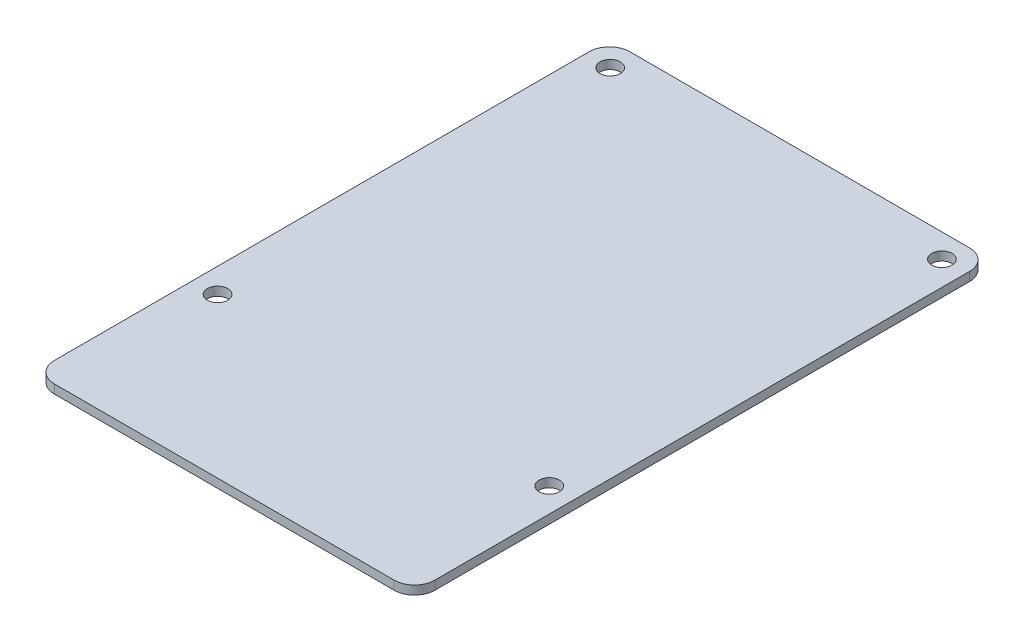
ISO-10303-21;
HEADER;
FILE_DESCRIPTION(('STEP AP214'),'2;1');
FILE_NAME('part.step','',(''),(''),'','','');
FILE_SCHEMA(('AUTOMOTIVE_DESIGN { 1 0 10303 214 1 1 1 1 }'));
ENDSEC;
DATA;
#1=APPLICATION_CONTEXT('core data for automotive mechanical design processes');
#2=APPLICATION_PROTOCOL_DEFINITION('international standard','automotive_design',2000,#1);
#3=PRODUCT_CONTEXT('',#1,'mechanical');
#4=PRODUCT('Part','Part','',(#3));
#5=PRODUCT_RELATED_PRODUCT_CATEGORY('part','',(#4));
#6=PRODUCT_DEFINITION_FORMATION('','',#4);
#7=PRODUCT_DEFINITION_CONTEXT('part definition',#1,'design');
#8=PRODUCT_DEFINITION('design','',#6,#7);
#9=PRODUCT_DEFINITION_SHAPE('','',#8);
#10=(LENGTH_UNIT() NAMED_UNIT(*) SI_UNIT(.MILLI.,.METRE.));
#11=(NAMED_UNIT(*) PLANE_ANGLE_UNIT() SI_UNIT($,.RADIAN.));
#12=(NAMED_UNIT(*) SI_UNIT($,.STERADIAN.) SOLID_ANGLE_UNIT());
#13=UNCERTAINTY_MEASURE_WITH_UNIT(LENGTH_MEASURE(1.E-05),#10,'distance_accuracy_value','');
#14=(GEOMETRIC_REPRESENTATION_CONTEXT(3) GLOBAL_UNCERTAINTY_ASSIGNED_CONTEXT((#13)) GLOBAL_UNIT_ASSIGNED_CONTEXT((#10,
#11,#12)) REPRESENTATION_CONTEXT('',''));
#15=CARTESIAN_POINT('',(0.,0.,0.));
#16=DIRECTION('',(0.,0.,1.));
#17=DIRECTION('',(1.,0.,0.));
#18=AXIS2_PLACEMENT_3D('',#15,#16,#17);
#19=CARTESIAN_POINT('',(0.,0.,0.));
#20=DIRECTION('',(0.,1.,0.));
#21=DIRECTION('',(0.,0.,1.));
#22=AXIS2_PLACEMENT_3D('',#19,#20,#21);
#23=PLANE('',#22);
#24=CARTESIAN_POINT('',(-24.5,0.,19.));
#25=DIRECTION('',(0.,1.,0.));
#26=DIRECTION('',(0.,0.,1.));
#27=AXIS2_PLACEMENT_3D('',#24,#25,#26);
#28=CIRCLE('',#27,1.5);
#29=CARTESIAN_POINT('',(-24.5,0.,20.5));
#30=VERTEX_POINT('',#29);
#31=EDGE_CURVE('E138',#30,#30,#28,.T.);
#32=ORIENTED_EDGE('',*,*,#31,.T.);
#33=EDGE_LOOP('',(#32));
#34=FACE_BOUND('',#33,.T.);
#35=CARTESIAN_POINT('',(-24.5,0.,-39.));
#36=DIRECTION('',(0.,1.,0.));
#37=DIRECTION('',(0.,0.,1.));
#38=AXIS2_PLACEMENT_3D('',#35,#36,#37);
#39=CIRCLE('',#38,1.5);
#40=CARTESIAN_POINT('',(-24.5,0.,-37.5));
#41=VERTEX_POINT('',#40);
#42=EDGE_CURVE('E141',#41,#41,#39,.T.);
#43=ORIENTED_EDGE('',*,*,#42,.T.);
#44=EDGE_LOOP('',(#43));
#45=FACE_BOUND('',#44,.T.);
#46=CARTESIAN_POINT('',(24.5,0.,-39.));
#47=DIRECTION('',(0.,1.,0.));
#48=DIRECTION('',(0.,0.,1.));
#49=AXIS2_PLACEMENT_3D('',#46,#47,#48);
#50=CIRCLE('',#49,1.5);
#51=CARTESIAN_POINT('',(24.5,0.,-37.5));
#52=VERTEX_POINT('',#51);
#53=EDGE_CURVE('E144',#52,#52,#50,.T.);
#54=ORIENTED_EDGE('',*,*,#53,.T.);
#55=EDGE_LOOP('',(#54));
#56=FACE_BOUND('',#55,.T.);
#57=CARTESIAN_POINT('',(24.5,0.,19.));
#58=DIRECTION('',(0.,1.,0.));
#59=DIRECTION('',(0.,0.,1.));
#60=AXIS2_PLACEMENT_3D('',#57,#58,#59);
#61=CIRCLE('',#60,1.5);
#62=CARTESIAN_POINT('',(24.5,0.,20.5));
#63=VERTEX_POINT('',#62);
#64=EDGE_CURVE('E147',#63,#63,#61,.T.);
#65=ORIENTED_EDGE('',*,*,#64,.T.);
#66=EDGE_LOOP('',(#65));
#67=FACE_BOUND('',#66,.T.);
#68=CARTESIAN_POINT('',(25.1,0.,-39.5));
#69=DIRECTION('',(0.,1.,0.));
#70=DIRECTION('',(0.,0.,1.));
#71=AXIS2_PLACEMENT_3D('',#68,#69,#70);
#72=CIRCLE('',#71,2.99999999999999);
#73=CARTESIAN_POINT('',(28.1,0.,-39.5));
#74=VERTEX_POINT('',#73);
#75=CARTESIAN_POINT('',(25.1,0.,-42.5));
#76=VERTEX_POINT('',#75);
#77=EDGE_CURVE('E150',#74,#76,#72,.T.);
#78=ORIENTED_EDGE('',*,*,#77,.F.);
#79=DIRECTION('',(0.,0.,-1.));
#80=VECTOR('',#79,1.);
#81=CARTESIAN_POINT('',(28.1,0.,39.5));
#82=LINE('',#81,#80);
#83=CARTESIAN_POINT('',(28.1,0.,39.5));
#84=VERTEX_POINT('',#83);
#85=EDGE_CURVE('E107',#84,#74,#82,.T.);
#86=ORIENTED_EDGE('',*,*,#85,.F.);
#87=CARTESIAN_POINT('',(25.1,0.,39.5));
#88=DIRECTION('',(0.,1.,0.));
#89=DIRECTION('',(0.,0.,1.));
#90=AXIS2_PLACEMENT_3D('',#87,#88,#89);
#91=CIRCLE('',#90,2.99999999999999);
#92=CARTESIAN_POINT('',(25.1,0.,42.5));
#93=VERTEX_POINT('',#92);
#94=EDGE_CURVE('E154',#93,#84,#91,.T.);
#95=ORIENTED_EDGE('',*,*,#94,.F.);
#96=DIRECTION('',(1.,0.,0.));
#97=VECTOR('',#96,1.);
#98=CARTESIAN_POINT('',(-25.1,0.,42.5));
#99=LINE('',#98,#97);
#100=CARTESIAN_POINT('',(-25.1,0.,42.5));
#101=VERTEX_POINT('',#100);
#102=EDGE_CURVE('E112',#101,#93,#99,.T.);
#103=ORIENTED_EDGE('',*,*,#102,.F.);
#104=CARTESIAN_POINT('',(-25.1,0.,39.5));
#105=DIRECTION('',(0.,1.,0.));
#106=DIRECTION('',(0.,0.,1.));
#107=AXIS2_PLACEMENT_3D('',#104,#105,#106);
#108=CIRCLE('',#107,2.99999999999999);
#109=CARTESIAN_POINT('',(-28.1,0.,39.5));
#110=VERTEX_POINT('',#109);
#111=EDGE_CURVE('E84',#110,#101,#108,.T.);
#112=ORIENTED_EDGE('',*,*,#111,.F.);
#113=DIRECTION('',(0.,0.,1.));
#114=VECTOR('',#113,1.);
#115=CARTESIAN_POINT('',(-28.1,0.,-39.5));
#116=LINE('',#115,#114);
#117=CARTESIAN_POINT('',(-28.1,0.,-39.5));
#118=VERTEX_POINT('',#117);
#119=EDGE_CURVE('E82',#118,#110,#116,.T.);
#120=ORIENTED_EDGE('',*,*,#119,.F.);
#121=CARTESIAN_POINT('',(-25.1,0.,-39.5));
#122=DIRECTION('',(0.,1.,0.));
#123=DIRECTION('',(0.,0.,1.));
#124=AXIS2_PLACEMENT_3D('',#121,#122,#123);
#125=CIRCLE('',#124,2.99999999999998);
#126=CARTESIAN_POINT('',(-25.1,0.,-42.5));
#127=VERTEX_POINT('',#126);
#128=EDGE_CURVE('E20',#127,#118,#125,.T.);
#129=ORIENTED_EDGE('',*,*,#128,.F.);
#130=DIRECTION('',(-1.,0.,0.));
#131=VECTOR('',#130,1.);
#132=CARTESIAN_POINT('',(25.1,0.,-42.5));
#133=LINE('',#132,#131);
#134=EDGE_CURVE('E96',#76,#127,#133,.T.);
#135=ORIENTED_EDGE('',*,*,#134,.F.);
#136=EDGE_LOOP('',(#78,#86,#95,#103,#112,#120,#129,#135));
#137=FACE_BOUND('',#136,.T.);
#138=ADVANCED_FACE('F17',(#34,#45,#56,#67,#137),#23,.F.);
#139=CARTESIAN_POINT('',(25.1,0.,-42.5));
#140=DIRECTION('',(0.,0.,-1.));
#141=DIRECTION('',(-1.,0.,0.));
#142=AXIS2_PLACEMENT_3D('',#139,#140,#141);
#143=PLANE('',#142);
#144=DIRECTION('',(1.,0.,0.));
#145=VECTOR('',#144,1.);
#146=CARTESIAN_POINT('',(0.,1.3,-42.5));
#147=LINE('',#146,#145);
#148=CARTESIAN_POINT('',(25.1,1.3,-42.5));
#149=VERTEX_POINT('',#148);
#150=CARTESIAN_POINT('',(-25.1,1.3,-42.5));
#151=VERTEX_POINT('',#150);
#152=EDGE_CURVE('E137',#149,#151,#147,.F.);
#153=ORIENTED_EDGE('',*,*,#152,.F.);
#154=DIRECTION('',(0.,1.,0.));
#155=VECTOR('',#154,1.);
#156=CARTESIAN_POINT('',(25.1,0.,-42.5));
#157=LINE('',#156,#155);
#158=EDGE_CURVE('E153',#76,#149,#157,.T.);
#159=ORIENTED_EDGE('',*,*,#158,.F.);
#160=ORIENTED_EDGE('',*,*,#134,.T.);
#161=DIRECTION('',(0.,1.,0.));
#162=VECTOR('',#161,1.);
#163=CARTESIAN_POINT('',(-25.1,0.,-42.5));
#164=LINE('',#163,#162);
#165=EDGE_CURVE('E89',#151,#127,#164,.F.);
#166=ORIENTED_EDGE('',*,*,#165,.F.);
#167=EDGE_LOOP('',(#153,#159,#160,#166));
#168=FACE_BOUND('',#167,.T.);
#169=ADVANCED_FACE('F185',(#168),#143,.T.);
#170=CARTESIAN_POINT('',(-25.1,0.,-39.5));
#171=DIRECTION('',(0.,1.,0.));
#172=DIRECTION('',(0.,0.,1.));
#173=AXIS2_PLACEMENT_3D('',#170,#171,#172);
#174=CYLINDRICAL_SURFACE('',#173,2.99999999999998);
#175=CARTESIAN_POINT('',(-25.1,1.3,-39.5));
#176=DIRECTION('',(0.,1.,0.));
#177=DIRECTION('',(0.,0.,1.));
#178=AXIS2_PLACEMENT_3D('',#175,#176,#177);
#179=CIRCLE('',#178,2.99999999999998);
#180=CARTESIAN_POINT('',(-28.1,1.3,-39.5));
#181=VERTEX_POINT('',#180);
#182=EDGE_CURVE('E135',#151,#181,#179,.T.);
#183=ORIENTED_EDGE('',*,*,#182,.F.);
#184=ORIENTED_EDGE('',*,*,#165,.T.);
#185=ORIENTED_EDGE('',*,*,#128,.T.);
#186=DIRECTION('',(0.,1.,0.));
#187=VECTOR('',#186,1.);
#188=CARTESIAN_POINT('',(-28.1,0.,-39.5));
#189=LINE('',#188,#187);
#190=EDGE_CURVE('E88',#181,#118,#189,.F.);
#191=ORIENTED_EDGE('',*,*,#190,.F.);
#192=EDGE_LOOP('',(#183,#184,#185,#191));
#193=FACE_BOUND('',#192,.T.);
#194=ADVANCED_FACE('F94',(#193),#174,.T.);
#195=CARTESIAN_POINT('',(-28.1,0.,-39.5));
#196=DIRECTION('',(-1.,0.,0.));
#197=DIRECTION('',(0.,0.,1.));
#198=AXIS2_PLACEMENT_3D('',#195,#196,#197);
#199=PLANE('',#198);
#200=DIRECTION('',(0.,0.,1.));
#201=VECTOR('',#200,1.);
#202=CARTESIAN_POINT('',(-28.1,1.3,0.));
#203=LINE('',#202,#201);
#204=CARTESIAN_POINT('',(-28.1,1.3,39.5));
#205=VERTEX_POINT('',#204);
#206=EDGE_CURVE('E99',#181,#205,#203,.T.);
#207=ORIENTED_EDGE('',*,*,#206,.F.);
#208=ORIENTED_EDGE('',*,*,#190,.T.);
#209=ORIENTED_EDGE('',*,*,#119,.T.);
#210=DIRECTION('',(0.,1.,0.));
#211=VECTOR('',#210,1.);
#212=CARTESIAN_POINT('',(-28.1,0.,39.5));
#213=LINE('',#212,#211);
#214=EDGE_CURVE('E102',#205,#110,#213,.F.);
#215=ORIENTED_EDGE('',*,*,#214,.F.);
#216=EDGE_LOOP('',(#207,#208,#209,#215));
#217=FACE_BOUND('',#216,.T.);
#218=ADVANCED_FACE('F97',(#217),#199,.T.);
#219=CARTESIAN_POINT('',(-25.1,0.,39.5));
#220=DIRECTION('',(0.,1.,0.));
#221=DIRECTION('',(0.,0.,1.));
#222=AXIS2_PLACEMENT_3D('',#219,#220,#221);
#223=CYLINDRICAL_SURFACE('',#222,2.99999999999999);
#224=CARTESIAN_POINT('',(-25.1,1.3,39.5));
#225=DIRECTION('',(0.,1.,0.));
#226=DIRECTION('',(0.,0.,1.));
#227=AXIS2_PLACEMENT_3D('',#224,#225,#226);
#228=CIRCLE('',#227,2.99999999999999);
#229=CARTESIAN_POINT('',(-25.1,1.3,42.5));
#230=VERTEX_POINT('',#229);
#231=EDGE_CURVE('E132',#205,#230,#228,.T.);
#232=ORIENTED_EDGE('',*,*,#231,.F.);
#233=ORIENTED_EDGE('',*,*,#214,.T.);
#234=ORIENTED_EDGE('',*,*,#111,.T.);
#235=DIRECTION('',(0.,1.,0.));
#236=VECTOR('',#235,1.);
#237=CARTESIAN_POINT('',(-25.1,0.,42.5));
#238=LINE('',#237,#236);
#239=EDGE_CURVE('E114',#230,#101,#238,.F.);
#240=ORIENTED_EDGE('',*,*,#239,.F.);
#241=EDGE_LOOP('',(#232,#233,#234,#240));
#242=FACE_BOUND('',#241,.T.);
#243=ADVANCED_FACE('F182',(#242),#223,.T.);
#244=CARTESIAN_POINT('',(-25.1,0.,42.5));
#245=DIRECTION('',(0.,0.,1.));
#246=DIRECTION('',(1.,0.,0.));
#247=AXIS2_PLACEMENT_3D('',#244,#245,#246);
#248=PLANE('',#247);
#249=DIRECTION('',(1.,0.,0.));
#250=VECTOR('',#249,1.);
#251=CARTESIAN_POINT('',(0.,1.3,42.5));
#252=LINE('',#251,#250);
#253=CARTESIAN_POINT('',(25.1,1.3,42.5));
#254=VERTEX_POINT('',#253);
#255=EDGE_CURVE('E131',#230,#254,#252,.T.);
#256=ORIENTED_EDGE('',*,*,#255,.F.);
#257=ORIENTED_EDGE('',*,*,#239,.T.);
#258=ORIENTED_EDGE('',*,*,#102,.T.);
#259=DIRECTION('',(0.,1.,0.));
#260=VECTOR('',#259,1.);
#261=CARTESIAN_POINT('',(25.1,0.,42.5));
#262=LINE('',#261,#260);
#263=EDGE_CURVE('E110',#254,#93,#262,.F.);
#264=ORIENTED_EDGE('',*,*,#263,.F.);
#265=EDGE_LOOP('',(#256,#257,#258,#264));
#266=FACE_BOUND('',#265,.T.);
#267=ADVANCED_FACE('F180',(#266),#248,.T.);
#268=CARTESIAN_POINT('',(25.1,0.,39.5));
#269=DIRECTION('',(0.,1.,0.));
#270=DIRECTION('',(0.,0.,1.));
#271=AXIS2_PLACEMENT_3D('',#268,#269,#270);
#272=CYLINDRICAL_SURFACE('',#271,2.99999999999999);
#273=CARTESIAN_POINT('',(25.1,1.3,39.5));
#274=DIRECTION('',(0.,1.,0.));
#275=DIRECTION('',(0.,0.,1.));
#276=AXIS2_PLACEMENT_3D('',#273,#274,#275);
#277=CIRCLE('',#276,2.99999999999999);
#278=CARTESIAN_POINT('',(28.1,1.3,39.5));
#279=VERTEX_POINT('',#278);
#280=EDGE_CURVE('E128',#254,#279,#277,.T.);
#281=ORIENTED_EDGE('',*,*,#280,.F.);
#282=ORIENTED_EDGE('',*,*,#263,.T.);
#283=ORIENTED_EDGE('',*,*,#94,.T.);
#284=DIRECTION('',(0.,1.,0.));
#285=VECTOR('',#284,1.);
#286=CARTESIAN_POINT('',(28.1,0.,39.5));
#287=LINE('',#286,#285);
#288=EDGE_CURVE('E109',#279,#84,#287,.F.);
#289=ORIENTED_EDGE('',*,*,#288,.F.);
#290=EDGE_LOOP('',(#281,#282,#283,#289));
#291=FACE_BOUND('',#290,.T.);
#292=ADVANCED_FACE('F178',(#291),#272,.T.);
#293=CARTESIAN_POINT('',(28.1,0.,39.5));
#294=DIRECTION('',(1.,0.,0.));
#295=DIRECTION('',(0.,0.,-1.));
#296=AXIS2_PLACEMENT_3D('',#293,#294,#295);
#297=PLANE('',#296);
#298=DIRECTION('',(0.,0.,1.));
#299=VECTOR('',#298,1.);
#300=CARTESIAN_POINT('',(28.1,1.3,0.));
#301=LINE('',#300,#299);
#302=CARTESIAN_POINT('',(28.1,1.3,-39.5));
#303=VERTEX_POINT('',#302);
#304=EDGE_CURVE('E127',#279,#303,#301,.F.);
#305=ORIENTED_EDGE('',*,*,#304,.F.);
#306=ORIENTED_EDGE('',*,*,#288,.T.);
#307=ORIENTED_EDGE('',*,*,#85,.T.);
#308=DIRECTION('',(0.,1.,0.));
#309=VECTOR('',#308,1.);
#310=CARTESIAN_POINT('',(28.1,0.,-39.5));
#311=LINE('',#310,#309);
#312=EDGE_CURVE('E35',#303,#74,#311,.F.);
#313=ORIENTED_EDGE('',*,*,#312,.F.);
#314=EDGE_LOOP('',(#305,#306,#307,#313));
#315=FACE_BOUND('',#314,.T.);
#316=ADVANCED_FACE('F177',(#315),#297,.T.);
#317=CARTESIAN_POINT('',(25.1,0.,-39.5));
#318=DIRECTION('',(0.,1.,0.));
#319=DIRECTION('',(0.,0.,1.));
#320=AXIS2_PLACEMENT_3D('',#317,#318,#319);
#321=CYLINDRICAL_SURFACE('',#320,2.99999999999999);
#322=CARTESIAN_POINT('',(25.1,1.3,-39.5));
#323=DIRECTION('',(0.,1.,0.));
#324=DIRECTION('',(0.,0.,1.));
#325=AXIS2_PLACEMENT_3D('',#322,#323,#324);
#326=CIRCLE('',#325,2.99999999999999);
#327=EDGE_CURVE('E124',#303,#149,#326,.T.);
#328=ORIENTED_EDGE('',*,*,#327,.F.);
#329=ORIENTED_EDGE('',*,*,#312,.T.);
#330=ORIENTED_EDGE('',*,*,#77,.T.);
#331=ORIENTED_EDGE('',*,*,#158,.T.);
#332=EDGE_LOOP('',(#328,#329,#330,#331));
#333=FACE_BOUND('',#332,.T.);
#334=ADVANCED_FACE('F187',(#333),#321,.T.);
#335=CARTESIAN_POINT('',(24.5,0.,19.));
#336=DIRECTION('',(0.,1.,0.));
#337=DIRECTION('',(0.,0.,1.));
#338=AXIS2_PLACEMENT_3D('',#335,#336,#337);
#339=CYLINDRICAL_SURFACE('',#338,1.5);
#340=ORIENTED_EDGE('',*,*,#64,.F.);
#341=EDGE_LOOP('',(#340));
#342=FACE_BOUND('',#341,.T.);
#343=CARTESIAN_POINT('',(24.5,1.3,19.));
#344=DIRECTION('',(0.,1.,0.));
#345=DIRECTION('',(0.,0.,1.));
#346=AXIS2_PLACEMENT_3D('',#343,#344,#345);
#347=CIRCLE('',#346,1.5);
#348=CARTESIAN_POINT('',(24.5,1.3,20.5));
#349=VERTEX_POINT('',#348);
#350=EDGE_CURVE('E121',#349,#349,#347,.F.);
#351=ORIENTED_EDGE('',*,*,#350,.F.);
#352=EDGE_LOOP('',(#351));
#353=FACE_BOUND('',#352,.T.);
#354=ADVANCED_FACE('F189',(#342,#353),#339,.F.);
#355=CARTESIAN_POINT('',(24.5,0.,-39.));
#356=DIRECTION('',(0.,1.,0.));
#357=DIRECTION('',(0.,0.,1.));
#358=AXIS2_PLACEMENT_3D('',#355,#356,#357);
#359=CYLINDRICAL_SURFACE('',#358,1.5);
#360=ORIENTED_EDGE('',*,*,#53,.F.);
#361=EDGE_LOOP('',(#360));
#362=FACE_BOUND('',#361,.T.);
#363=CARTESIAN_POINT('',(24.5,1.3,-39.));
#364=DIRECTION('',(0.,1.,0.));
#365=DIRECTION('',(0.,0.,1.));
#366=AXIS2_PLACEMENT_3D('',#363,#364,#365);
#367=CIRCLE('',#366,1.5);
#368=CARTESIAN_POINT('',(24.5,1.3,-37.5));
#369=VERTEX_POINT('',#368);
#370=EDGE_CURVE('E118',#369,#369,#367,.F.);
#371=ORIENTED_EDGE('',*,*,#370,.F.);
#372=EDGE_LOOP('',(#371));
#373=FACE_BOUND('',#372,.T.);
#374=ADVANCED_FACE('F196',(#362,#373),#359,.F.);
#375=CARTESIAN_POINT('',(-24.5,0.,-39.));
#376=DIRECTION('',(0.,1.,0.));
#377=DIRECTION('',(0.,0.,1.));
#378=AXIS2_PLACEMENT_3D('',#375,#376,#377);
#379=CYLINDRICAL_SURFACE('',#378,1.5);
#380=ORIENTED_EDGE('',*,*,#42,.F.);
#381=EDGE_LOOP('',(#380));
#382=FACE_BOUND('',#381,.T.);
#383=CARTESIAN_POINT('',(-24.5,1.3,-39.));
#384=DIRECTION('',(0.,1.,0.));
#385=DIRECTION('',(0.,0.,1.));
#386=AXIS2_PLACEMENT_3D('',#383,#384,#385);
#387=CIRCLE('',#386,1.5);
#388=CARTESIAN_POINT('',(-24.5,1.3,-37.5));
#389=VERTEX_POINT('',#388);
#390=EDGE_CURVE('E26',#389,#389,#387,.F.);
#391=ORIENTED_EDGE('',*,*,#390,.F.);
#392=EDGE_LOOP('',(#391));
#393=FACE_BOUND('',#392,.T.);
#394=ADVANCED_FACE('F207',(#382,#393),#379,.F.);
#395=CARTESIAN_POINT('',(-24.5,0.,19.));
#396=DIRECTION('',(0.,1.,0.));
#397=DIRECTION('',(0.,0.,1.));
#398=AXIS2_PLACEMENT_3D('',#395,#396,#397);
#399=CYLINDRICAL_SURFACE('',#398,1.5);
#400=ORIENTED_EDGE('',*,*,#31,.F.);
#401=EDGE_LOOP('',(#400));
#402=FACE_BOUND('',#401,.T.);
#403=CARTESIAN_POINT('',(-24.5,1.3,19.));
#404=DIRECTION('',(0.,1.,0.));
#405=DIRECTION('',(0.,0.,1.));
#406=AXIS2_PLACEMENT_3D('',#403,#404,#405);
#407=CIRCLE('',#406,1.5);
#408=CARTESIAN_POINT('',(-24.5,1.3,20.5));
#409=VERTEX_POINT('',#408);
#410=EDGE_CURVE('E11',#409,#409,#407,.F.);
#411=ORIENTED_EDGE('',*,*,#410,.F.);
#412=EDGE_LOOP('',(#411));
#413=FACE_BOUND('',#412,.T.);
#414=ADVANCED_FACE('F201',(#402,#413),#399,.F.);
#415=CARTESIAN_POINT('',(0.,1.3,0.));
#416=DIRECTION('',(0.,1.,0.));
#417=DIRECTION('',(0.,0.,1.));
#418=AXIS2_PLACEMENT_3D('',#415,#416,#417);
#419=PLANE('',#418);
#420=ORIENTED_EDGE('',*,*,#410,.T.);
#421=EDGE_LOOP('',(#420));
#422=FACE_BOUND('',#421,.T.);
#423=ORIENTED_EDGE('',*,*,#390,.T.);
#424=EDGE_LOOP('',(#423));
#425=FACE_BOUND('',#424,.T.);
#426=ORIENTED_EDGE('',*,*,#370,.T.);
#427=EDGE_LOOP('',(#426));
#428=FACE_BOUND('',#427,.T.);
#429=ORIENTED_EDGE('',*,*,#350,.T.);
#430=EDGE_LOOP('',(#429));
#431=FACE_BOUND('',#430,.T.);
#432=ORIENTED_EDGE('',*,*,#304,.T.);
#433=ORIENTED_EDGE('',*,*,#327,.T.);
#434=ORIENTED_EDGE('',*,*,#152,.T.);
#435=ORIENTED_EDGE('',*,*,#182,.T.);
#436=ORIENTED_EDGE('',*,*,#206,.T.);
#437=ORIENTED_EDGE('',*,*,#231,.T.);
#438=ORIENTED_EDGE('',*,*,#255,.T.);
#439=ORIENTED_EDGE('',*,*,#280,.T.);
#440=EDGE_LOOP('',(#432,#433,#434,#435,#436,#437,#438,#439));
#441=FACE_BOUND('',#440,.T.);
#442=ADVANCED_FACE('F175',(#422,#425,#428,#431,#441),#419,.T.);
#443=CLOSED_SHELL('',(#138,#169,#194,#218,#243,#267,#292,#316,#334,#354,#374,#394,#414,#442));
#444=MANIFOLD_SOLID_BREP('B1',#443);
#445=ADVANCED_BREP_SHAPE_REPRESENTATION('',(#18,#444),#14);
#446=SHAPE_DEFINITION_REPRESENTATION(#9,#445);
ENDSEC;
END-ISO-10303-21;
